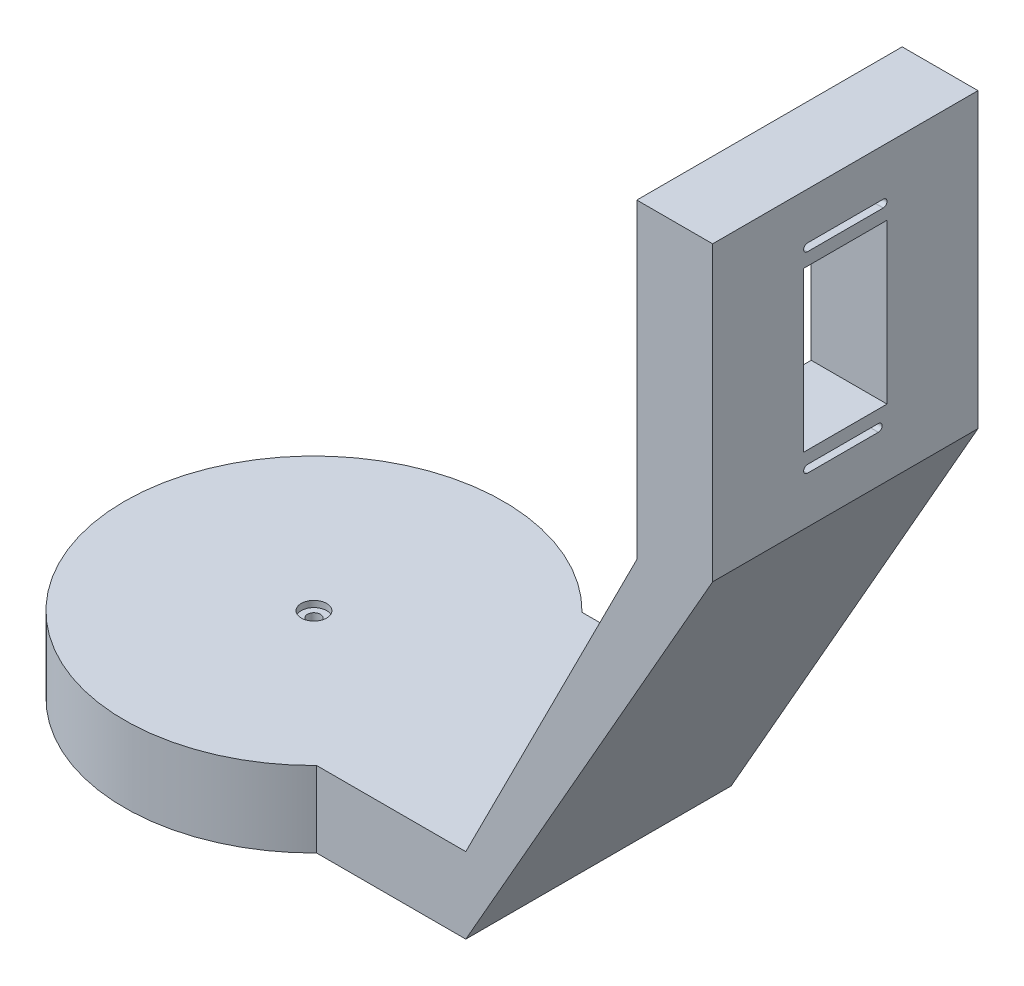
ISO-10303-21;
HEADER;
FILE_DESCRIPTION(('STEP AP214'),'2;1');
FILE_NAME('part.step','',(''),(''),'','','');
FILE_SCHEMA(('AUTOMOTIVE_DESIGN { 1 0 10303 214 1 1 1 1 }'));
ENDSEC;
DATA;
#1=APPLICATION_CONTEXT('core data for automotive mechanical design processes');
#2=APPLICATION_PROTOCOL_DEFINITION('international standard','automotive_design',2000,#1);
#3=PRODUCT_CONTEXT('',#1,'mechanical');
#4=PRODUCT('Part','Part','',(#3));
#5=PRODUCT_RELATED_PRODUCT_CATEGORY('part','',(#4));
#6=PRODUCT_DEFINITION_FORMATION('','',#4);
#7=PRODUCT_DEFINITION_CONTEXT('part definition',#1,'design');
#8=PRODUCT_DEFINITION('design','',#6,#7);
#9=PRODUCT_DEFINITION_SHAPE('','',#8);
#10=(LENGTH_UNIT() NAMED_UNIT(*) SI_UNIT(.MILLI.,.METRE.));
#11=(NAMED_UNIT(*) PLANE_ANGLE_UNIT() SI_UNIT($,.RADIAN.));
#12=(NAMED_UNIT(*) SI_UNIT($,.STERADIAN.) SOLID_ANGLE_UNIT());
#13=UNCERTAINTY_MEASURE_WITH_UNIT(LENGTH_MEASURE(1.E-05),#10,'distance_accuracy_value','');
#14=(GEOMETRIC_REPRESENTATION_CONTEXT(3) GLOBAL_UNCERTAINTY_ASSIGNED_CONTEXT((#13)) GLOBAL_UNIT_ASSIGNED_CONTEXT((#10,
#11,#12)) REPRESENTATION_CONTEXT('',''));
#15=CARTESIAN_POINT('',(0.,0.,0.));
#16=DIRECTION('',(0.,0.,1.));
#17=DIRECTION('',(1.,0.,0.));
#18=AXIS2_PLACEMENT_3D('',#15,#16,#17);
#19=CARTESIAN_POINT('',(0.,20.,0.));
#20=DIRECTION('',(0.,1.,0.));
#21=DIRECTION('',(0.,0.,1.));
#22=AXIS2_PLACEMENT_3D('',#19,#20,#21);
#23=CYLINDRICAL_SURFACE('',#22,1.7);
#24=CARTESIAN_POINT('',(0.,18.35,0.));
#25=DIRECTION('',(0.,1.,0.));
#26=DIRECTION('',(0.,0.,1.));
#27=AXIS2_PLACEMENT_3D('',#24,#25,#26);
#28=CIRCLE('',#27,1.7);
#29=CARTESIAN_POINT('',(0.,18.35,1.7));
#30=VERTEX_POINT('',#29);
#31=EDGE_CURVE('E388',#30,#30,#28,.T.);
#32=ORIENTED_EDGE('',*,*,#31,.T.);
#33=EDGE_LOOP('',(#32));
#34=FACE_BOUND('',#33,.T.);
#35=CARTESIAN_POINT('',(0.,3.5,0.));
#36=DIRECTION('',(0.,-1.,0.));
#37=DIRECTION('',(0.,0.,-1.));
#38=AXIS2_PLACEMENT_3D('',#35,#36,#37);
#39=CIRCLE('',#38,1.7);
#40=CARTESIAN_POINT('',(0.,3.5,-1.7));
#41=VERTEX_POINT('',#40);
#42=EDGE_CURVE('E42',#41,#41,#39,.F.);
#43=ORIENTED_EDGE('',*,*,#42,.F.);
#44=EDGE_LOOP('',(#43));
#45=FACE_BOUND('',#44,.T.);
#46=ADVANCED_FACE('F38',(#34,#45),#23,.F.);
#47=CARTESIAN_POINT('',(30.,2.,-0.0220346998523853));
#48=DIRECTION('',(0.,-1.,0.));
#49=DIRECTION('',(0.,0.,-1.));
#50=AXIS2_PLACEMENT_3D('',#47,#48,#49);
#51=PLANE('',#50);
#52=DIRECTION('',(0.,0.,1.));
#53=VECTOR('',#52,1.);
#54=CARTESIAN_POINT('',(10.446834113617,2.,-0.0220346998523853));
#55=LINE('',#54,#53);
#56=CARTESIAN_POINT('',(10.446834113617,2.,-4.95844978584569));
#57=VERTEX_POINT('',#56);
#58=CARTESIAN_POINT('',(10.446834113617,2.,4.94470051522393));
#59=VERTEX_POINT('',#58);
#60=EDGE_CURVE('E277',#57,#59,#55,.T.);
#61=ORIENTED_EDGE('',*,*,#60,.F.);
#62=DIRECTION('',(-0.995066694728679,0.,-0.0992082307157115));
#63=VECTOR('',#62,1.);
#64=CARTESIAN_POINT('',(29.889613094827,2.,-3.02000313383669));
#65=LINE('',#64,#63);
#66=CARTESIAN_POINT('',(29.889613094827,2.,-3.02000313383669));
#67=VERTEX_POINT('',#66);
#68=EDGE_CURVE('E301',#67,#57,#65,.T.);
#69=ORIENTED_EDGE('',*,*,#68,.F.);
#70=CARTESIAN_POINT('',(30.,2.,-0.0220346998523853));
#71=DIRECTION('',(0.,-1.,0.));
#72=DIRECTION('',(0.,0.,-1.));
#73=AXIS2_PLACEMENT_3D('',#70,#71,#72);
#74=CIRCLE('',#73,3.);
#75=CARTESIAN_POINT('',(29.9254967375497,2.,2.97704003477566));
#76=VERTEX_POINT('',#75);
#77=EDGE_CURVE('E287',#67,#76,#74,.T.);
#78=ORIENTED_EDGE('',*,*,#77,.T.);
#79=DIRECTION('',(-0.994936582249236,0.,0.100504712835816));
#80=VECTOR('',#79,1.);
#81=CARTESIAN_POINT('',(29.9254967375497,2.,2.97704003477566));
#82=LINE('',#81,#80);
#83=EDGE_CURVE('E290',#76,#59,#82,.T.);
#84=ORIENTED_EDGE('',*,*,#83,.T.);
#85=EDGE_LOOP('',(#61,#69,#78,#84));
#86=FACE_BOUND('',#85,.T.);
#87=ADVANCED_FACE('F552',(#86),#51,.T.);
#88=CARTESIAN_POINT('',(0.,20.,0.));
#89=DIRECTION('',(0.,-1.,0.));
#90=DIRECTION('',(0.,0.,-1.));
#91=AXIS2_PLACEMENT_3D('',#88,#89,#90);
#92=CYLINDRICAL_SURFACE('',#91,50.);
#93=CARTESIAN_POINT('',(0.,0.,0.));
#94=DIRECTION('',(0.,1.,0.));
#95=DIRECTION('',(0.,0.,1.));
#96=AXIS2_PLACEMENT_3D('',#93,#94,#95);
#97=CIRCLE('',#96,50.);
#98=CARTESIAN_POINT('',(35.7071421427143,0.,-35.));
#99=VERTEX_POINT('',#98);
#100=CARTESIAN_POINT('',(35.7071421427143,0.,35.));
#101=VERTEX_POINT('',#100);
#102=EDGE_CURVE('E424',#99,#101,#97,.T.);
#103=ORIENTED_EDGE('',*,*,#102,.T.);
#104=DIRECTION('',(0.,-1.,0.));
#105=VECTOR('',#104,1.);
#106=CARTESIAN_POINT('',(35.7071421427143,20.,35.));
#107=LINE('',#106,#105);
#108=CARTESIAN_POINT('',(35.7071421427143,20.,35.));
#109=VERTEX_POINT('',#108);
#110=EDGE_CURVE('E452',#109,#101,#107,.T.);
#111=ORIENTED_EDGE('',*,*,#110,.F.);
#112=CARTESIAN_POINT('',(0.,20.,0.));
#113=DIRECTION('',(0.,1.,0.));
#114=DIRECTION('',(0.,0.,1.));
#115=AXIS2_PLACEMENT_3D('',#112,#113,#114);
#116=CIRCLE('',#115,50.);
#117=CARTESIAN_POINT('',(35.7071421427143,20.,-35.));
#118=VERTEX_POINT('',#117);
#119=EDGE_CURVE('E430',#118,#109,#116,.T.);
#120=ORIENTED_EDGE('',*,*,#119,.F.);
#121=DIRECTION('',(0.,-1.,0.));
#122=VECTOR('',#121,1.);
#123=CARTESIAN_POINT('',(35.7071421427143,20.,-35.));
#124=LINE('',#123,#122);
#125=EDGE_CURVE('E442',#118,#99,#124,.T.);
#126=ORIENTED_EDGE('',*,*,#125,.T.);
#127=EDGE_LOOP('',(#103,#111,#120,#126));
#128=FACE_BOUND('',#127,.T.);
#129=ADVANCED_FACE('F40',(#128),#92,.T.);
#130=CARTESIAN_POINT('',(0.,20.,35.));
#131=DIRECTION('',(0.,0.,-1.));
#132=DIRECTION('',(-1.,0.,0.));
#133=AXIS2_PLACEMENT_3D('',#130,#131,#132);
#134=PLANE('',#133);
#135=DIRECTION('',(1.,0.,0.));
#136=VECTOR('',#135,1.);
#137=CARTESIAN_POINT('',(0.,0.,35.));
#138=LINE('',#137,#136);
#139=CARTESIAN_POINT('',(75.0554768047186,0.,35.));
#140=VERTEX_POINT('',#139);
#141=EDGE_CURVE('E445',#101,#140,#138,.T.);
#142=ORIENTED_EDGE('',*,*,#141,.T.);
#143=DIRECTION('',(0.495370386359118,0.868681863698338,0.));
#144=VECTOR('',#143,1.);
#145=CARTESIAN_POINT('',(75.0554768047186,0.,35.));
#146=LINE('',#145,#144);
#147=CARTESIAN_POINT('',(140.174133176639,114.192122372215,35.));
#148=VERTEX_POINT('',#147);
#149=EDGE_CURVE('E396',#140,#148,#146,.T.);
#150=ORIENTED_EDGE('',*,*,#149,.T.);
#151=DIRECTION('',(0.,1.,0.));
#152=VECTOR('',#151,1.);
#153=CARTESIAN_POINT('',(140.174133176639,114.192122372215,35.));
#154=LINE('',#153,#152);
#155=CARTESIAN_POINT('',(140.174133176639,191.411564080646,35.));
#156=VERTEX_POINT('',#155);
#157=EDGE_CURVE('E391',#148,#156,#154,.T.);
#158=ORIENTED_EDGE('',*,*,#157,.T.);
#159=DIRECTION('',(-1.,0.,0.));
#160=VECTOR('',#159,1.);
#161=CARTESIAN_POINT('',(140.174133176639,191.411564080646,35.));
#162=LINE('',#161,#160);
#163=CARTESIAN_POINT('',(120.174133176639,191.411564080646,35.));
#164=VERTEX_POINT('',#163);
#165=EDGE_CURVE('E411',#156,#164,#162,.T.);
#166=ORIENTED_EDGE('',*,*,#165,.T.);
#167=DIRECTION('',(0.,-1.,0.));
#168=VECTOR('',#167,1.);
#169=CARTESIAN_POINT('',(120.174133176639,191.411564080646,35.));
#170=LINE('',#169,#168);
#171=CARTESIAN_POINT('',(120.174133176639,109.286292207177,35.));
#172=VERTEX_POINT('',#171);
#173=EDGE_CURVE('E414',#164,#172,#170,.T.);
#174=ORIENTED_EDGE('',*,*,#173,.T.);
#175=DIRECTION('',(-0.451012165575392,-0.892517801784925,0.));
#176=VECTOR('',#175,1.);
#177=CARTESIAN_POINT('',(120.174133176639,109.286292207177,35.));
#178=LINE('',#177,#176);
#179=CARTESIAN_POINT('',(75.0554768047186,20.,35.));
#180=VERTEX_POINT('',#179);
#181=EDGE_CURVE('E417',#172,#180,#178,.T.);
#182=ORIENTED_EDGE('',*,*,#181,.T.);
#183=DIRECTION('',(1.,0.,0.));
#184=VECTOR('',#183,1.);
#185=CARTESIAN_POINT('',(0.,20.,35.));
#186=LINE('',#185,#184);
#187=EDGE_CURVE('E433',#109,#180,#186,.T.);
#188=ORIENTED_EDGE('',*,*,#187,.F.);
#189=ORIENTED_EDGE('',*,*,#110,.T.);
#190=EDGE_LOOP('',(#142,#150,#158,#166,#174,#182,#188,#189));
#191=FACE_BOUND('',#190,.T.);
#192=ADVANCED_FACE('F517',(#191),#134,.F.);
#193=CARTESIAN_POINT('',(0.,20.,-35.));
#194=DIRECTION('',(0.,0.,-1.));
#195=DIRECTION('',(-1.,0.,0.));
#196=AXIS2_PLACEMENT_3D('',#193,#194,#195);
#197=PLANE('',#196);
#198=DIRECTION('',(1.,0.,0.));
#199=VECTOR('',#198,1.);
#200=CARTESIAN_POINT('',(0.,0.,-35.));
#201=LINE('',#200,#199);
#202=CARTESIAN_POINT('',(75.0554768047186,0.,-35.));
#203=VERTEX_POINT('',#202);
#204=EDGE_CURVE('E434',#99,#203,#201,.T.);
#205=ORIENTED_EDGE('',*,*,#204,.F.);
#206=ORIENTED_EDGE('',*,*,#125,.F.);
#207=DIRECTION('',(1.,0.,0.));
#208=VECTOR('',#207,1.);
#209=CARTESIAN_POINT('',(0.,20.,-35.));
#210=LINE('',#209,#208);
#211=CARTESIAN_POINT('',(75.0554768047186,20.,-35.));
#212=VERTEX_POINT('',#211);
#213=EDGE_CURVE('E439',#118,#212,#210,.T.);
#214=ORIENTED_EDGE('',*,*,#213,.T.);
#215=DIRECTION('',(-0.451012165575392,-0.892517801784925,0.));
#216=VECTOR('',#215,1.);
#217=CARTESIAN_POINT('',(120.174133176639,109.286292207177,-35.));
#218=LINE('',#217,#216);
#219=CARTESIAN_POINT('',(120.174133176639,109.286292207177,-35.));
#220=VERTEX_POINT('',#219);
#221=EDGE_CURVE('E402',#220,#212,#218,.T.);
#222=ORIENTED_EDGE('',*,*,#221,.F.);
#223=DIRECTION('',(0.,-1.,0.));
#224=VECTOR('',#223,1.);
#225=CARTESIAN_POINT('',(120.174133176639,191.411564080646,-35.));
#226=LINE('',#225,#224);
#227=CARTESIAN_POINT('',(120.174133176639,191.411564080646,-35.));
#228=VERTEX_POINT('',#227);
#229=EDGE_CURVE('E399',#228,#220,#226,.T.);
#230=ORIENTED_EDGE('',*,*,#229,.F.);
#231=DIRECTION('',(-1.,0.,0.));
#232=VECTOR('',#231,1.);
#233=CARTESIAN_POINT('',(140.174133176639,191.411564080646,-35.));
#234=LINE('',#233,#232);
#235=CARTESIAN_POINT('',(140.174133176639,191.411564080646,-35.));
#236=VERTEX_POINT('',#235);
#237=EDGE_CURVE('E395',#236,#228,#234,.T.);
#238=ORIENTED_EDGE('',*,*,#237,.F.);
#239=DIRECTION('',(0.,1.,0.));
#240=VECTOR('',#239,1.);
#241=CARTESIAN_POINT('',(140.174133176639,114.192122372215,-35.));
#242=LINE('',#241,#240);
#243=CARTESIAN_POINT('',(140.174133176639,114.192122372215,-35.));
#244=VERTEX_POINT('',#243);
#245=EDGE_CURVE('E392',#244,#236,#242,.T.);
#246=ORIENTED_EDGE('',*,*,#245,.F.);
#247=DIRECTION('',(0.495370386359118,0.868681863698338,0.));
#248=VECTOR('',#247,1.);
#249=CARTESIAN_POINT('',(75.0554768047186,0.,-35.));
#250=LINE('',#249,#248);
#251=EDGE_CURVE('E405',#203,#244,#250,.T.);
#252=ORIENTED_EDGE('',*,*,#251,.F.);
#253=EDGE_LOOP('',(#205,#206,#214,#222,#230,#238,#246,#252));
#254=FACE_BOUND('',#253,.T.);
#255=ADVANCED_FACE('F523',(#254),#197,.T.);
#256=CARTESIAN_POINT('',(0.,20.,0.));
#257=DIRECTION('',(0.,1.,0.));
#258=DIRECTION('',(0.,0.,1.));
#259=AXIS2_PLACEMENT_3D('',#256,#257,#258);
#260=PLANE('',#259);
#261=CARTESIAN_POINT('',(0.,20.,0.));
#262=DIRECTION('',(0.,1.,0.));
#263=DIRECTION('',(0.,0.,1.));
#264=AXIS2_PLACEMENT_3D('',#261,#262,#263);
#265=CIRCLE('',#264,3.35);
#266=CARTESIAN_POINT('',(0.,20.,3.35));
#267=VERTEX_POINT('',#266);
#268=EDGE_CURVE('E376',#267,#267,#265,.T.);
#269=ORIENTED_EDGE('',*,*,#268,.F.);
#270=EDGE_LOOP('',(#269));
#271=FACE_BOUND('',#270,.T.);
#272=ORIENTED_EDGE('',*,*,#119,.T.);
#273=ORIENTED_EDGE('',*,*,#187,.T.);
#274=DIRECTION('',(0.,0.,1.));
#275=VECTOR('',#274,1.);
#276=CARTESIAN_POINT('',(75.0554768047186,20.,0.));
#277=LINE('',#276,#275);
#278=EDGE_CURVE('E436',#212,#180,#277,.T.);
#279=ORIENTED_EDGE('',*,*,#278,.F.);
#280=ORIENTED_EDGE('',*,*,#213,.F.);
#281=EDGE_LOOP('',(#272,#273,#279,#280));
#282=FACE_BOUND('',#281,.T.);
#283=ADVANCED_FACE('F536',(#271,#282),#260,.T.);
#284=CARTESIAN_POINT('',(0.,0.,0.));
#285=DIRECTION('',(0.,1.,0.));
#286=DIRECTION('',(0.,0.,1.));
#287=AXIS2_PLACEMENT_3D('',#284,#285,#286);
#288=PLANE('',#287);
#289=DIRECTION('',(-0.994936582249236,0.,0.100504712835816));
#290=VECTOR('',#289,1.);
#291=CARTESIAN_POINT('',(29.9254967375497,0.,2.97704003477566));
#292=LINE('',#291,#290);
#293=CARTESIAN_POINT('',(29.9254967375497,0.,2.97704003477566));
#294=VERTEX_POINT('',#293);
#295=CARTESIAN_POINT('',(0.,0.,6.));
#296=VERTEX_POINT('',#295);
#297=EDGE_CURVE('E245',#294,#296,#292,.T.);
#298=ORIENTED_EDGE('',*,*,#297,.F.);
#299=CARTESIAN_POINT('',(30.,0.,-0.0220346998523853));
#300=DIRECTION('',(0.,-1.,0.));
#301=DIRECTION('',(0.,0.,-1.));
#302=AXIS2_PLACEMENT_3D('',#299,#300,#301);
#303=CIRCLE('',#302,3.);
#304=CARTESIAN_POINT('',(29.889613094827,0.,-3.02000313383669));
#305=VERTEX_POINT('',#304);
#306=EDGE_CURVE('E54',#305,#294,#303,.T.);
#307=ORIENTED_EDGE('',*,*,#306,.F.);
#308=DIRECTION('',(-0.995066694728679,0.,-0.0992082307157115));
#309=VECTOR('',#308,1.);
#310=CARTESIAN_POINT('',(29.889613094827,0.,-3.02000313383669));
#311=LINE('',#310,#309);
#312=CARTESIAN_POINT('',(0.,0.,-6.));
#313=VERTEX_POINT('',#312);
#314=EDGE_CURVE('E291',#305,#313,#311,.T.);
#315=ORIENTED_EDGE('',*,*,#314,.T.);
#316=DIRECTION('',(0.998337055490868,0.,-0.0576465405191379));
#317=VECTOR('',#316,1.);
#318=CARTESIAN_POINT('',(-30.0737171703665,0.,-4.26346648570486));
#319=LINE('',#318,#317);
#320=CARTESIAN_POINT('',(-30.0737171703665,0.,-4.26346648570486));
#321=VERTEX_POINT('',#320);
#322=EDGE_CURVE('E311',#321,#313,#319,.T.);
#323=ORIENTED_EDGE('',*,*,#322,.F.);
#324=CARTESIAN_POINT('',(-30.,0.,-0.640077242931038));
#325=DIRECTION('',(0.,1.,0.));
#326=DIRECTION('',(0.,0.,1.));
#327=AXIS2_PLACEMENT_3D('',#324,#325,#326);
#328=CIRCLE('',#327,3.6241390461537);
#329=CARTESIAN_POINT('',(-29.9389781936391,0.,2.98354803639964));
#330=VERTEX_POINT('',#329);
#331=EDGE_CURVE('E308',#321,#330,#328,.T.);
#332=ORIENTED_EDGE('',*,*,#331,.T.);
#333=DIRECTION('',(0.994962701350082,0.,0.100245812491832));
#334=VECTOR('',#333,1.);
#335=CARTESIAN_POINT('',(-29.9389781936391,0.,2.98354803639964));
#336=LINE('',#335,#334);
#337=EDGE_CURVE('E306',#330,#296,#336,.T.);
#338=ORIENTED_EDGE('',*,*,#337,.T.);
#339=EDGE_LOOP('',(#298,#307,#315,#323,#332,#338));
#340=FACE_BOUND('',#339,.T.);
#341=ORIENTED_EDGE('',*,*,#102,.F.);
#342=ORIENTED_EDGE('',*,*,#204,.T.);
#343=DIRECTION('',(0.,0.,1.));
#344=VECTOR('',#343,1.);
#345=CARTESIAN_POINT('',(75.0554768047186,0.,0.));
#346=LINE('',#345,#344);
#347=EDGE_CURVE('E448',#203,#140,#346,.T.);
#348=ORIENTED_EDGE('',*,*,#347,.T.);
#349=ORIENTED_EDGE('',*,*,#141,.F.);
#350=EDGE_LOOP('',(#341,#342,#348,#349));
#351=FACE_BOUND('',#350,.T.);
#352=ADVANCED_FACE('F502',(#340,#351),#288,.F.);
#353=CARTESIAN_POINT('',(140.174133176639,114.192122372215,-35.));
#354=DIRECTION('',(1.,0.,0.));
#355=DIRECTION('',(0.,0.,-1.));
#356=AXIS2_PLACEMENT_3D('',#353,#354,#355);
#357=PLANE('',#356);
#358=CARTESIAN_POINT('',(140.174133176639,178.101564080646,10.));
#359=DIRECTION('',(1.,0.,0.));
#360=DIRECTION('',(0.,0.,-1.));
#361=AXIS2_PLACEMENT_3D('',#358,#359,#360);
#362=CIRCLE('',#361,1.);
#363=CARTESIAN_POINT('',(140.174133176639,179.101564080646,10.));
#364=VERTEX_POINT('',#363);
#365=CARTESIAN_POINT('',(140.174133176639,177.101564080646,10.));
#366=VERTEX_POINT('',#365);
#367=EDGE_CURVE('E62',#364,#366,#362,.T.);
#368=ORIENTED_EDGE('',*,*,#367,.F.);
#369=DIRECTION('',(0.,0.,1.));
#370=VECTOR('',#369,1.);
#371=CARTESIAN_POINT('',(140.174133176639,179.101564080646,10.));
#372=LINE('',#371,#370);
#373=CARTESIAN_POINT('',(140.174133176639,179.101564080646,-10.));
#374=VERTEX_POINT('',#373);
#375=EDGE_CURVE('E333',#374,#364,#372,.T.);
#376=ORIENTED_EDGE('',*,*,#375,.F.);
#377=CARTESIAN_POINT('',(140.174133176639,178.101564080646,-10.));
#378=DIRECTION('',(1.,0.,0.));
#379=DIRECTION('',(0.,0.,1.));
#380=AXIS2_PLACEMENT_3D('',#377,#378,#379);
#381=CIRCLE('',#380,1.);
#382=CARTESIAN_POINT('',(140.174133176639,177.101564080646,-10.));
#383=VERTEX_POINT('',#382);
#384=EDGE_CURVE('E330',#383,#374,#381,.T.);
#385=ORIENTED_EDGE('',*,*,#384,.F.);
#386=DIRECTION('',(0.,0.,-1.));
#387=VECTOR('',#386,1.);
#388=CARTESIAN_POINT('',(140.174133176639,177.101564080646,10.));
#389=LINE('',#388,#387);
#390=EDGE_CURVE('E326',#366,#383,#389,.T.);
#391=ORIENTED_EDGE('',*,*,#390,.F.);
#392=EDGE_LOOP('',(#368,#376,#385,#391));
#393=FACE_BOUND('',#392,.T.);
#394=CARTESIAN_POINT('',(140.174133176639,127.501564080646,10.));
#395=DIRECTION('',(1.,0.,0.));
#396=DIRECTION('',(0.,0.,-1.));
#397=AXIS2_PLACEMENT_3D('',#394,#395,#396);
#398=CIRCLE('',#397,1.);
#399=CARTESIAN_POINT('',(140.174133176639,128.501564080646,10.));
#400=VERTEX_POINT('',#399);
#401=CARTESIAN_POINT('',(140.174133176639,126.501564080646,10.));
#402=VERTEX_POINT('',#401);
#403=EDGE_CURVE('E317',#400,#402,#398,.T.);
#404=ORIENTED_EDGE('',*,*,#403,.F.);
#405=DIRECTION('',(0.,0.,1.));
#406=VECTOR('',#405,1.);
#407=CARTESIAN_POINT('',(140.174133176639,128.501564080646,10.));
#408=LINE('',#407,#406);
#409=CARTESIAN_POINT('',(140.174133176639,128.501564080646,-8.70627595615708));
#410=VERTEX_POINT('',#409);
#411=EDGE_CURVE('E352',#410,#400,#408,.T.);
#412=ORIENTED_EDGE('',*,*,#411,.F.);
#413=CARTESIAN_POINT('',(140.174133176639,127.501564080646,-8.70627595615708));
#414=DIRECTION('',(1.,0.,0.));
#415=DIRECTION('',(0.,0.,1.));
#416=AXIS2_PLACEMENT_3D('',#413,#414,#415);
#417=CIRCLE('',#416,1.00000000000003);
#418=CARTESIAN_POINT('',(140.174133176639,126.501564080646,-8.70627595615708));
#419=VERTEX_POINT('',#418);
#420=EDGE_CURVE('E349',#419,#410,#417,.T.);
#421=ORIENTED_EDGE('',*,*,#420,.F.);
#422=DIRECTION('',(0.,0.,-1.));
#423=VECTOR('',#422,1.);
#424=CARTESIAN_POINT('',(140.174133176639,126.501564080646,10.));
#425=LINE('',#424,#423);
#426=EDGE_CURVE('E346',#402,#419,#425,.T.);
#427=ORIENTED_EDGE('',*,*,#426,.F.);
#428=EDGE_LOOP('',(#404,#412,#421,#427));
#429=FACE_BOUND('',#428,.T.);
#430=DIRECTION('',(0.,-1.,0.));
#431=VECTOR('',#430,1.);
#432=CARTESIAN_POINT('',(140.174133176639,173.801564080646,11.));
#433=LINE('',#432,#431);
#434=CARTESIAN_POINT('',(140.174133176639,173.801564080646,11.));
#435=VERTEX_POINT('',#434);
#436=CARTESIAN_POINT('',(140.174133176639,131.801564080646,11.));
#437=VERTEX_POINT('',#436);
#438=EDGE_CURVE('E339',#435,#437,#433,.T.);
#439=ORIENTED_EDGE('',*,*,#438,.F.);
#440=DIRECTION('',(0.,0.,1.));
#441=VECTOR('',#440,1.);
#442=CARTESIAN_POINT('',(140.174133176639,173.801564080646,11.));
#443=LINE('',#442,#441);
#444=CARTESIAN_POINT('',(140.174133176639,173.801564080646,-11.));
#445=VERTEX_POINT('',#444);
#446=EDGE_CURVE('E370',#445,#435,#443,.T.);
#447=ORIENTED_EDGE('',*,*,#446,.F.);
#448=DIRECTION('',(0.,1.,0.));
#449=VECTOR('',#448,1.);
#450=CARTESIAN_POINT('',(140.174133176639,173.801564080646,-11.));
#451=LINE('',#450,#449);
#452=CARTESIAN_POINT('',(140.174133176639,131.801564080646,-11.));
#453=VERTEX_POINT('',#452);
#454=EDGE_CURVE('E367',#453,#445,#451,.T.);
#455=ORIENTED_EDGE('',*,*,#454,.F.);
#456=DIRECTION('',(0.,0.,-1.));
#457=VECTOR('',#456,1.);
#458=CARTESIAN_POINT('',(140.174133176639,131.801564080646,11.));
#459=LINE('',#458,#457);
#460=EDGE_CURVE('E364',#437,#453,#459,.T.);
#461=ORIENTED_EDGE('',*,*,#460,.F.);
#462=EDGE_LOOP('',(#439,#447,#455,#461));
#463=FACE_BOUND('',#462,.T.);
#464=ORIENTED_EDGE('',*,*,#157,.F.);
#465=DIRECTION('',(0.,0.,1.));
#466=VECTOR('',#465,1.);
#467=CARTESIAN_POINT('',(140.174133176639,114.192122372215,-35.));
#468=LINE('',#467,#466);
#469=EDGE_CURVE('E422',#244,#148,#468,.T.);
#470=ORIENTED_EDGE('',*,*,#469,.F.);
#471=ORIENTED_EDGE('',*,*,#245,.T.);
#472=DIRECTION('',(0.,0.,1.));
#473=VECTOR('',#472,1.);
#474=CARTESIAN_POINT('',(140.174133176639,191.411564080646,-35.));
#475=LINE('',#474,#473);
#476=EDGE_CURVE('E408',#236,#156,#475,.T.);
#477=ORIENTED_EDGE('',*,*,#476,.T.);
#478=EDGE_LOOP('',(#464,#470,#471,#477));
#479=FACE_BOUND('',#478,.T.);
#480=ADVANCED_FACE('F498',(#393,#429,#463,#479),#357,.T.);
#481=CARTESIAN_POINT('',(75.0554768047186,0.,-35.));
#482=DIRECTION('',(0.868681863698338,-0.495370386359118,0.));
#483=DIRECTION('',(0.495370386359118,0.868681863698338,0.));
#484=AXIS2_PLACEMENT_3D('',#481,#482,#483);
#485=PLANE('',#484);
#486=ORIENTED_EDGE('',*,*,#149,.F.);
#487=ORIENTED_EDGE('',*,*,#347,.F.);
#488=ORIENTED_EDGE('',*,*,#251,.T.);
#489=ORIENTED_EDGE('',*,*,#469,.T.);
#490=EDGE_LOOP('',(#486,#487,#488,#489));
#491=FACE_BOUND('',#490,.T.);
#492=ADVANCED_FACE('F501',(#491),#485,.T.);
#493=CARTESIAN_POINT('',(120.174133176639,109.286292207177,-35.));
#494=DIRECTION('',(-0.892517801784925,0.451012165575392,0.));
#495=DIRECTION('',(-0.451012165575392,-0.892517801784925,0.));
#496=AXIS2_PLACEMENT_3D('',#493,#494,#495);
#497=PLANE('',#496);
#498=ORIENTED_EDGE('',*,*,#181,.F.);
#499=DIRECTION('',(0.,0.,1.));
#500=VECTOR('',#499,1.);
#501=CARTESIAN_POINT('',(120.174133176639,109.286292207177,-35.));
#502=LINE('',#501,#500);
#503=EDGE_CURVE('E425',#220,#172,#502,.T.);
#504=ORIENTED_EDGE('',*,*,#503,.F.);
#505=ORIENTED_EDGE('',*,*,#221,.T.);
#506=ORIENTED_EDGE('',*,*,#278,.T.);
#507=EDGE_LOOP('',(#498,#504,#505,#506));
#508=FACE_BOUND('',#507,.T.);
#509=ADVANCED_FACE('F533',(#508),#497,.T.);
#510=CARTESIAN_POINT('',(120.174133176639,191.411564080646,-35.));
#511=DIRECTION('',(-1.,0.,0.));
#512=DIRECTION('',(0.,0.,1.));
#513=AXIS2_PLACEMENT_3D('',#510,#511,#512);
#514=PLANE('',#513);
#515=CARTESIAN_POINT('',(120.174133176639,178.101564080646,10.));
#516=DIRECTION('',(-1.,0.,0.));
#517=DIRECTION('',(0.,0.,1.));
#518=AXIS2_PLACEMENT_3D('',#515,#516,#517);
#519=CIRCLE('',#518,1.);
#520=CARTESIAN_POINT('',(120.174133176639,177.101564080646,10.));
#521=VERTEX_POINT('',#520);
#522=CARTESIAN_POINT('',(120.174133176639,179.101564080646,10.));
#523=VERTEX_POINT('',#522);
#524=EDGE_CURVE('E11',#521,#523,#519,.T.);
#525=ORIENTED_EDGE('',*,*,#524,.F.);
#526=DIRECTION('',(0.,0.,1.));
#527=VECTOR('',#526,1.);
#528=CARTESIAN_POINT('',(120.174133176639,177.101564080646,-35.));
#529=LINE('',#528,#527);
#530=CARTESIAN_POINT('',(120.174133176639,177.101564080646,-9.99999999999999));
#531=VERTEX_POINT('',#530);
#532=EDGE_CURVE('E473',#531,#521,#529,.T.);
#533=ORIENTED_EDGE('',*,*,#532,.F.);
#534=CARTESIAN_POINT('',(120.174133176639,178.101564080646,-10.));
#535=DIRECTION('',(-1.,0.,0.));
#536=DIRECTION('',(0.,0.,1.));
#537=AXIS2_PLACEMENT_3D('',#534,#535,#536);
#538=CIRCLE('',#537,1.);
#539=CARTESIAN_POINT('',(120.174133176639,179.101564080646,-10.));
#540=VERTEX_POINT('',#539);
#541=EDGE_CURVE('E475',#540,#531,#538,.T.);
#542=ORIENTED_EDGE('',*,*,#541,.F.);
#543=DIRECTION('',(0.,0.,-1.));
#544=VECTOR('',#543,1.);
#545=CARTESIAN_POINT('',(120.174133176639,179.101564080646,-35.));
#546=LINE('',#545,#544);
#547=EDGE_CURVE('E47',#523,#540,#546,.T.);
#548=ORIENTED_EDGE('',*,*,#547,.F.);
#549=EDGE_LOOP('',(#525,#533,#542,#548));
#550=FACE_BOUND('',#549,.T.);
#551=CARTESIAN_POINT('',(120.174133176639,127.501564080646,10.));
#552=DIRECTION('',(-1.,0.,0.));
#553=DIRECTION('',(0.,0.,1.));
#554=AXIS2_PLACEMENT_3D('',#551,#552,#553);
#555=CIRCLE('',#554,1.);
#556=CARTESIAN_POINT('',(120.174133176639,126.501564080646,10.));
#557=VERTEX_POINT('',#556);
#558=CARTESIAN_POINT('',(120.174133176639,128.501564080646,10.));
#559=VERTEX_POINT('',#558);
#560=EDGE_CURVE('E471',#557,#559,#555,.T.);
#561=ORIENTED_EDGE('',*,*,#560,.F.);
#562=DIRECTION('',(0.,0.,1.));
#563=VECTOR('',#562,1.);
#564=CARTESIAN_POINT('',(120.174133176639,126.501564080646,-34.9999999999999));
#565=LINE('',#564,#563);
#566=CARTESIAN_POINT('',(120.174133176639,126.501564080646,-8.70627595615708));
#567=VERTEX_POINT('',#566);
#568=EDGE_CURVE('E464',#567,#557,#565,.T.);
#569=ORIENTED_EDGE('',*,*,#568,.F.);
#570=CARTESIAN_POINT('',(120.174133176639,127.501564080646,-8.70627595615708));
#571=DIRECTION('',(-1.,0.,0.));
#572=DIRECTION('',(0.,0.,1.));
#573=AXIS2_PLACEMENT_3D('',#570,#571,#572);
#574=CIRCLE('',#573,1.00000000000003);
#575=CARTESIAN_POINT('',(120.174133176639,128.501564080646,-8.70627595615708));
#576=VERTEX_POINT('',#575);
#577=EDGE_CURVE('E466',#576,#567,#574,.T.);
#578=ORIENTED_EDGE('',*,*,#577,.F.);
#579=DIRECTION('',(0.,0.,-1.));
#580=VECTOR('',#579,1.);
#581=CARTESIAN_POINT('',(120.174133176639,128.501564080646,-35.0000000000001));
#582=LINE('',#581,#580);
#583=EDGE_CURVE('E469',#559,#576,#582,.T.);
#584=ORIENTED_EDGE('',*,*,#583,.F.);
#585=EDGE_LOOP('',(#561,#569,#578,#584));
#586=FACE_BOUND('',#585,.T.);
#587=DIRECTION('',(0.,1.,0.));
#588=VECTOR('',#587,1.);
#589=CARTESIAN_POINT('',(120.174133176639,191.411564080646,11.));
#590=LINE('',#589,#588);
#591=CARTESIAN_POINT('',(120.174133176639,131.801564080646,11.));
#592=VERTEX_POINT('',#591);
#593=CARTESIAN_POINT('',(120.174133176639,173.801564080646,11.));
#594=VERTEX_POINT('',#593);
#595=EDGE_CURVE('E462',#592,#594,#590,.T.);
#596=ORIENTED_EDGE('',*,*,#595,.F.);
#597=DIRECTION('',(0.,0.,1.));
#598=VECTOR('',#597,1.);
#599=CARTESIAN_POINT('',(120.174133176639,131.801564080646,-35.));
#600=LINE('',#599,#598);
#601=CARTESIAN_POINT('',(120.174133176639,131.801564080646,-11.));
#602=VERTEX_POINT('',#601);
#603=EDGE_CURVE('E455',#602,#592,#600,.T.);
#604=ORIENTED_EDGE('',*,*,#603,.F.);
#605=DIRECTION('',(0.,-1.,0.));
#606=VECTOR('',#605,1.);
#607=CARTESIAN_POINT('',(120.174133176639,191.411564080646,-11.));
#608=LINE('',#607,#606);
#609=CARTESIAN_POINT('',(120.174133176639,173.801564080646,-11.));
#610=VERTEX_POINT('',#609);
#611=EDGE_CURVE('E457',#610,#602,#608,.T.);
#612=ORIENTED_EDGE('',*,*,#611,.F.);
#613=DIRECTION('',(0.,0.,-1.));
#614=VECTOR('',#613,1.);
#615=CARTESIAN_POINT('',(120.174133176639,173.801564080646,-35.));
#616=LINE('',#615,#614);
#617=EDGE_CURVE('E460',#594,#610,#616,.T.);
#618=ORIENTED_EDGE('',*,*,#617,.F.);
#619=EDGE_LOOP('',(#596,#604,#612,#618));
#620=FACE_BOUND('',#619,.T.);
#621=ORIENTED_EDGE('',*,*,#173,.F.);
#622=DIRECTION('',(0.,0.,1.));
#623=VECTOR('',#622,1.);
#624=CARTESIAN_POINT('',(120.174133176639,191.411564080646,-35.));
#625=LINE('',#624,#623);
#626=EDGE_CURVE('E427',#228,#164,#625,.T.);
#627=ORIENTED_EDGE('',*,*,#626,.F.);
#628=ORIENTED_EDGE('',*,*,#229,.T.);
#629=ORIENTED_EDGE('',*,*,#503,.T.);
#630=EDGE_LOOP('',(#621,#627,#628,#629));
#631=FACE_BOUND('',#630,.T.);
#632=ADVANCED_FACE('F491',(#550,#586,#620,#631),#514,.T.);
#633=CARTESIAN_POINT('',(140.174133176639,191.411564080646,-35.));
#634=DIRECTION('',(0.,1.,0.));
#635=DIRECTION('',(0.,0.,1.));
#636=AXIS2_PLACEMENT_3D('',#633,#634,#635);
#637=PLANE('',#636);
#638=ORIENTED_EDGE('',*,*,#165,.F.);
#639=ORIENTED_EDGE('',*,*,#476,.F.);
#640=ORIENTED_EDGE('',*,*,#237,.T.);
#641=ORIENTED_EDGE('',*,*,#626,.T.);
#642=EDGE_LOOP('',(#638,#639,#640,#641));
#643=FACE_BOUND('',#642,.T.);
#644=ADVANCED_FACE('F528',(#643),#637,.T.);
#645=CARTESIAN_POINT('',(1.7,18.35,0.));
#646=DIRECTION('',(0.,-1.,0.));
#647=DIRECTION('',(0.,0.,-1.));
#648=AXIS2_PLACEMENT_3D('',#645,#646,#647);
#649=PLANE('',#648);
#650=ORIENTED_EDGE('',*,*,#31,.F.);
#651=EDGE_LOOP('',(#650));
#652=FACE_BOUND('',#651,.T.);
#653=CARTESIAN_POINT('',(0.,18.35,0.));
#654=DIRECTION('',(0.,1.,0.));
#655=DIRECTION('',(0.,0.,1.));
#656=AXIS2_PLACEMENT_3D('',#653,#654,#655);
#657=CIRCLE('',#656,3.35);
#658=CARTESIAN_POINT('',(0.,18.35,3.35));
#659=VERTEX_POINT('',#658);
#660=EDGE_CURVE('E385',#659,#659,#657,.T.);
#661=ORIENTED_EDGE('',*,*,#660,.T.);
#662=EDGE_LOOP('',(#661));
#663=FACE_BOUND('',#662,.T.);
#664=ADVANCED_FACE('F564',(#652,#663),#649,.F.);
#665=CARTESIAN_POINT('',(0.,20.,0.));
#666=DIRECTION('',(0.,1.,0.));
#667=DIRECTION('',(0.,0.,1.));
#668=AXIS2_PLACEMENT_3D('',#665,#666,#667);
#669=CYLINDRICAL_SURFACE('',#668,3.35);
#670=ORIENTED_EDGE('',*,*,#660,.F.);
#671=EDGE_LOOP('',(#670));
#672=FACE_BOUND('',#671,.T.);
#673=ORIENTED_EDGE('',*,*,#268,.T.);
#674=EDGE_LOOP('',(#673));
#675=FACE_BOUND('',#674,.T.);
#676=ADVANCED_FACE('F576',(#672,#675),#669,.F.);
#677=CARTESIAN_POINT('',(108.174133176639,173.801564080646,11.));
#678=DIRECTION('',(0.,0.,1.));
#679=DIRECTION('',(0.,-1.,0.));
#680=AXIS2_PLACEMENT_3D('',#677,#678,#679);
#681=PLANE('',#680);
#682=ORIENTED_EDGE('',*,*,#595,.T.);
#683=DIRECTION('',(1.,0.,0.));
#684=VECTOR('',#683,1.);
#685=CARTESIAN_POINT('',(108.174133176639,173.801564080646,11.));
#686=LINE('',#685,#684);
#687=EDGE_CURVE('E374',#594,#435,#686,.T.);
#688=ORIENTED_EDGE('',*,*,#687,.T.);
#689=ORIENTED_EDGE('',*,*,#438,.T.);
#690=DIRECTION('',(1.,0.,0.));
#691=VECTOR('',#690,1.);
#692=CARTESIAN_POINT('',(108.174133176639,131.801564080646,11.));
#693=LINE('',#692,#691);
#694=EDGE_CURVE('E373',#592,#437,#693,.T.);
#695=ORIENTED_EDGE('',*,*,#694,.F.);
#696=EDGE_LOOP('',(#682,#688,#689,#695));
#697=FACE_BOUND('',#696,.T.);
#698=ADVANCED_FACE('F581',(#697),#681,.F.);
#699=CARTESIAN_POINT('',(108.174133176639,173.801564080646,11.));
#700=DIRECTION('',(0.,1.,0.));
#701=DIRECTION('',(0.,0.,1.));
#702=AXIS2_PLACEMENT_3D('',#699,#700,#701);
#703=PLANE('',#702);
#704=ORIENTED_EDGE('',*,*,#617,.T.);
#705=DIRECTION('',(1.,0.,0.));
#706=VECTOR('',#705,1.);
#707=CARTESIAN_POINT('',(108.174133176639,173.801564080646,-11.));
#708=LINE('',#707,#706);
#709=EDGE_CURVE('E377',#610,#445,#708,.T.);
#710=ORIENTED_EDGE('',*,*,#709,.T.);
#711=ORIENTED_EDGE('',*,*,#446,.T.);
#712=ORIENTED_EDGE('',*,*,#687,.F.);
#713=EDGE_LOOP('',(#704,#710,#711,#712));
#714=FACE_BOUND('',#713,.T.);
#715=ADVANCED_FACE('F591',(#714),#703,.F.);
#716=CARTESIAN_POINT('',(108.174133176639,173.801564080646,-11.));
#717=DIRECTION('',(0.,0.,-1.));
#718=DIRECTION('',(0.,1.,0.));
#719=AXIS2_PLACEMENT_3D('',#716,#717,#718);
#720=PLANE('',#719);
#721=ORIENTED_EDGE('',*,*,#611,.T.);
#722=DIRECTION('',(1.,0.,0.));
#723=VECTOR('',#722,1.);
#724=CARTESIAN_POINT('',(108.174133176639,131.801564080646,-11.));
#725=LINE('',#724,#723);
#726=EDGE_CURVE('E379',#602,#453,#725,.T.);
#727=ORIENTED_EDGE('',*,*,#726,.T.);
#728=ORIENTED_EDGE('',*,*,#454,.T.);
#729=ORIENTED_EDGE('',*,*,#709,.F.);
#730=EDGE_LOOP('',(#721,#727,#728,#729));
#731=FACE_BOUND('',#730,.T.);
#732=ADVANCED_FACE('F599',(#731),#720,.F.);
#733=CARTESIAN_POINT('',(108.174133176639,131.801564080646,11.));
#734=DIRECTION('',(0.,-1.,0.));
#735=DIRECTION('',(0.,0.,-1.));
#736=AXIS2_PLACEMENT_3D('',#733,#734,#735);
#737=PLANE('',#736);
#738=ORIENTED_EDGE('',*,*,#603,.T.);
#739=ORIENTED_EDGE('',*,*,#694,.T.);
#740=ORIENTED_EDGE('',*,*,#460,.T.);
#741=ORIENTED_EDGE('',*,*,#726,.F.);
#742=EDGE_LOOP('',(#738,#739,#740,#741));
#743=FACE_BOUND('',#742,.T.);
#744=ADVANCED_FACE('F595',(#743),#737,.F.);
#745=CARTESIAN_POINT('',(73.1741331766393,127.501564080646,10.));
#746=DIRECTION('',(1.,0.,0.));
#747=DIRECTION('',(0.,0.,-1.));
#748=AXIS2_PLACEMENT_3D('',#745,#746,#747);
#749=CYLINDRICAL_SURFACE('',#748,1.);
#750=ORIENTED_EDGE('',*,*,#560,.T.);
#751=DIRECTION('',(1.,0.,0.));
#752=VECTOR('',#751,1.);
#753=CARTESIAN_POINT('',(73.1741331766393,128.501564080646,10.));
#754=LINE('',#753,#752);
#755=EDGE_CURVE('E327',#559,#400,#754,.T.);
#756=ORIENTED_EDGE('',*,*,#755,.T.);
#757=ORIENTED_EDGE('',*,*,#403,.T.);
#758=DIRECTION('',(1.,0.,0.));
#759=VECTOR('',#758,1.);
#760=CARTESIAN_POINT('',(73.1741331766393,126.501564080646,10.));
#761=LINE('',#760,#759);
#762=EDGE_CURVE('E355',#557,#402,#761,.T.);
#763=ORIENTED_EDGE('',*,*,#762,.F.);
#764=EDGE_LOOP('',(#750,#756,#757,#763));
#765=FACE_BOUND('',#764,.T.);
#766=ADVANCED_FACE('F598',(#765),#749,.F.);
#767=CARTESIAN_POINT('',(73.1741331766393,128.501564080646,10.));
#768=DIRECTION('',(0.,1.,0.));
#769=DIRECTION('',(0.,0.,1.));
#770=AXIS2_PLACEMENT_3D('',#767,#768,#769);
#771=PLANE('',#770);
#772=ORIENTED_EDGE('',*,*,#583,.T.);
#773=DIRECTION('',(1.,0.,0.));
#774=VECTOR('',#773,1.);
#775=CARTESIAN_POINT('',(73.1741331766393,128.501564080646,-8.70627595615708));
#776=LINE('',#775,#774);
#777=EDGE_CURVE('E357',#576,#410,#776,.T.);
#778=ORIENTED_EDGE('',*,*,#777,.T.);
#779=ORIENTED_EDGE('',*,*,#411,.T.);
#780=ORIENTED_EDGE('',*,*,#755,.F.);
#781=EDGE_LOOP('',(#772,#778,#779,#780));
#782=FACE_BOUND('',#781,.T.);
#783=ADVANCED_FACE('F609',(#782),#771,.F.);
#784=CARTESIAN_POINT('',(73.1741331766393,127.501564080646,-8.70627595615708));
#785=DIRECTION('',(1.,0.,0.));
#786=DIRECTION('',(0.,0.,-1.));
#787=AXIS2_PLACEMENT_3D('',#784,#785,#786);
#788=CYLINDRICAL_SURFACE('',#787,1.00000000000003);
#789=ORIENTED_EDGE('',*,*,#577,.T.);
#790=DIRECTION('',(1.,0.,0.));
#791=VECTOR('',#790,1.);
#792=CARTESIAN_POINT('',(73.1741331766393,126.501564080646,-8.70627595615708));
#793=LINE('',#792,#791);
#794=EDGE_CURVE('E359',#567,#419,#793,.T.);
#795=ORIENTED_EDGE('',*,*,#794,.T.);
#796=ORIENTED_EDGE('',*,*,#420,.T.);
#797=ORIENTED_EDGE('',*,*,#777,.F.);
#798=EDGE_LOOP('',(#789,#795,#796,#797));
#799=FACE_BOUND('',#798,.T.);
#800=ADVANCED_FACE('F614',(#799),#788,.F.);
#801=CARTESIAN_POINT('',(73.1741331766393,126.501564080646,10.));
#802=DIRECTION('',(0.,-1.,0.));
#803=DIRECTION('',(0.,0.,-1.));
#804=AXIS2_PLACEMENT_3D('',#801,#802,#803);
#805=PLANE('',#804);
#806=ORIENTED_EDGE('',*,*,#568,.T.);
#807=ORIENTED_EDGE('',*,*,#762,.T.);
#808=ORIENTED_EDGE('',*,*,#426,.T.);
#809=ORIENTED_EDGE('',*,*,#794,.F.);
#810=EDGE_LOOP('',(#806,#807,#808,#809));
#811=FACE_BOUND('',#810,.T.);
#812=ADVANCED_FACE('F611',(#811),#805,.F.);
#813=CARTESIAN_POINT('',(73.1741331766393,178.101564080646,10.));
#814=DIRECTION('',(1.,0.,0.));
#815=DIRECTION('',(0.,0.,-1.));
#816=AXIS2_PLACEMENT_3D('',#813,#814,#815);
#817=CYLINDRICAL_SURFACE('',#816,1.);
#818=ORIENTED_EDGE('',*,*,#524,.T.);
#819=DIRECTION('',(1.,0.,0.));
#820=VECTOR('',#819,1.);
#821=CARTESIAN_POINT('',(73.1741331766393,179.101564080646,10.));
#822=LINE('',#821,#820);
#823=EDGE_CURVE('E337',#523,#364,#822,.T.);
#824=ORIENTED_EDGE('',*,*,#823,.T.);
#825=ORIENTED_EDGE('',*,*,#367,.T.);
#826=DIRECTION('',(1.,0.,0.));
#827=VECTOR('',#826,1.);
#828=CARTESIAN_POINT('',(73.1741331766393,177.101564080646,10.));
#829=LINE('',#828,#827);
#830=EDGE_CURVE('E336',#521,#366,#829,.T.);
#831=ORIENTED_EDGE('',*,*,#830,.F.);
#832=EDGE_LOOP('',(#818,#824,#825,#831));
#833=FACE_BOUND('',#832,.T.);
#834=ADVANCED_FACE('F496',(#833),#817,.F.);
#835=CARTESIAN_POINT('',(73.1741331766393,179.101564080646,10.));
#836=DIRECTION('',(0.,1.,0.));
#837=DIRECTION('',(0.,0.,1.));
#838=AXIS2_PLACEMENT_3D('',#835,#836,#837);
#839=PLANE('',#838);
#840=ORIENTED_EDGE('',*,*,#547,.T.);
#841=DIRECTION('',(1.,0.,0.));
#842=VECTOR('',#841,1.);
#843=CARTESIAN_POINT('',(73.1741331766393,179.101564080646,-10.));
#844=LINE('',#843,#842);
#845=EDGE_CURVE('E340',#540,#374,#844,.T.);
#846=ORIENTED_EDGE('',*,*,#845,.T.);
#847=ORIENTED_EDGE('',*,*,#375,.T.);
#848=ORIENTED_EDGE('',*,*,#823,.F.);
#849=EDGE_LOOP('',(#840,#846,#847,#848));
#850=FACE_BOUND('',#849,.T.);
#851=ADVANCED_FACE('F482',(#850),#839,.F.);
#852=CARTESIAN_POINT('',(73.1741331766393,178.101564080646,-10.));
#853=DIRECTION('',(1.,0.,0.));
#854=DIRECTION('',(0.,0.,-1.));
#855=AXIS2_PLACEMENT_3D('',#852,#853,#854);
#856=CYLINDRICAL_SURFACE('',#855,1.);
#857=ORIENTED_EDGE('',*,*,#541,.T.);
#858=DIRECTION('',(1.,0.,0.));
#859=VECTOR('',#858,1.);
#860=CARTESIAN_POINT('',(73.1741331766393,177.101564080646,-10.));
#861=LINE('',#860,#859);
#862=EDGE_CURVE('E342',#531,#383,#861,.T.);
#863=ORIENTED_EDGE('',*,*,#862,.T.);
#864=ORIENTED_EDGE('',*,*,#384,.T.);
#865=ORIENTED_EDGE('',*,*,#845,.F.);
#866=EDGE_LOOP('',(#857,#863,#864,#865));
#867=FACE_BOUND('',#866,.T.);
#868=ADVANCED_FACE('F487',(#867),#856,.F.);
#869=CARTESIAN_POINT('',(73.1741331766393,177.101564080646,10.));
#870=DIRECTION('',(0.,-1.,0.));
#871=DIRECTION('',(0.,0.,-1.));
#872=AXIS2_PLACEMENT_3D('',#869,#870,#871);
#873=PLANE('',#872);
#874=ORIENTED_EDGE('',*,*,#532,.T.);
#875=ORIENTED_EDGE('',*,*,#830,.T.);
#876=ORIENTED_EDGE('',*,*,#390,.T.);
#877=ORIENTED_EDGE('',*,*,#862,.F.);
#878=EDGE_LOOP('',(#874,#875,#876,#877));
#879=FACE_BOUND('',#878,.T.);
#880=ADVANCED_FACE('F494',(#879),#873,.F.);
#881=DIRECTION('',(0.,0.,-1.));
#882=VECTOR('',#881,1.);
#883=CARTESIAN_POINT('',(-10.4471083641759,2.,-0.0220346998523921));
#884=LINE('',#883,#882);
#885=CARTESIAN_POINT('',(-10.4471083641759,2.,4.94741896883577));
#886=VERTEX_POINT('',#885);
#887=CARTESIAN_POINT('',(-10.4471083641759,2.,-5.39675718504992));
#888=VERTEX_POINT('',#887);
#889=EDGE_CURVE('E285',#886,#888,#884,.T.);
#890=ORIENTED_EDGE('',*,*,#889,.F.);
#891=DIRECTION('',(0.994962701350082,0.,0.100245812491832));
#892=VECTOR('',#891,1.);
#893=CARTESIAN_POINT('',(-29.9389781936391,2.,2.98354803639964));
#894=LINE('',#893,#892);
#895=CARTESIAN_POINT('',(-29.9389781936391,2.,2.98354803639964));
#896=VERTEX_POINT('',#895);
#897=EDGE_CURVE('E294',#896,#886,#894,.T.);
#898=ORIENTED_EDGE('',*,*,#897,.F.);
#899=CARTESIAN_POINT('',(-30.,2.,-0.640077242931038));
#900=DIRECTION('',(0.,1.,0.));
#901=DIRECTION('',(0.,0.,1.));
#902=AXIS2_PLACEMENT_3D('',#899,#900,#901);
#903=CIRCLE('',#902,3.6241390461537);
#904=CARTESIAN_POINT('',(-30.0737171703665,2.,-4.26346648570486));
#905=VERTEX_POINT('',#904);
#906=EDGE_CURVE('E296',#905,#896,#903,.T.);
#907=ORIENTED_EDGE('',*,*,#906,.F.);
#908=DIRECTION('',(0.998337055490868,0.,-0.0576465405191379));
#909=VECTOR('',#908,1.);
#910=CARTESIAN_POINT('',(-30.0737171703665,2.,-4.26346648570486));
#911=LINE('',#910,#909);
#912=EDGE_CURVE('E298',#905,#888,#911,.T.);
#913=ORIENTED_EDGE('',*,*,#912,.T.);
#914=EDGE_LOOP('',(#890,#898,#907,#913));
#915=FACE_BOUND('',#914,.T.);
#916=ADVANCED_FACE('F560',(#915),#51,.T.);
#917=CARTESIAN_POINT('',(30.,2.,-0.0220346998523853));
#918=DIRECTION('',(0.,-1.,0.));
#919=DIRECTION('',(0.,0.,-1.));
#920=AXIS2_PLACEMENT_3D('',#917,#918,#919);
#921=CYLINDRICAL_SURFACE('',#920,3.);
#922=ORIENTED_EDGE('',*,*,#306,.T.);
#923=DIRECTION('',(0.,-1.,0.));
#924=VECTOR('',#923,1.);
#925=CARTESIAN_POINT('',(29.9254967375497,2.,2.97704003477566));
#926=LINE('',#925,#924);
#927=EDGE_CURVE('E249',#76,#294,#926,.T.);
#928=ORIENTED_EDGE('',*,*,#927,.F.);
#929=ORIENTED_EDGE('',*,*,#77,.F.);
#930=DIRECTION('',(0.,-1.,0.));
#931=VECTOR('',#930,1.);
#932=CARTESIAN_POINT('',(29.889613094827,2.,-3.02000313383669));
#933=LINE('',#932,#931);
#934=EDGE_CURVE('E315',#67,#305,#933,.T.);
#935=ORIENTED_EDGE('',*,*,#934,.T.);
#936=EDGE_LOOP('',(#922,#928,#929,#935));
#937=FACE_BOUND('',#936,.T.);
#938=ADVANCED_FACE('F630',(#937),#921,.F.);
#939=CARTESIAN_POINT('',(29.889613094827,2.,-3.02000313383669));
#940=DIRECTION('',(-0.0992082307157115,0.,0.995066694728679));
#941=DIRECTION('',(0.995066694728679,0.,0.0992082307157115));
#942=AXIS2_PLACEMENT_3D('',#939,#940,#941);
#943=PLANE('',#942);
#944=ORIENTED_EDGE('',*,*,#68,.T.);
#945=DIRECTION('',(0.,-1.,0.));
#946=VECTOR('',#945,1.);
#947=CARTESIAN_POINT('',(10.446834113617,3.5,-4.95844978584569));
#948=LINE('',#947,#946);
#949=CARTESIAN_POINT('',(10.446834113617,3.5,-4.95844978584569));
#950=VERTEX_POINT('',#949);
#951=EDGE_CURVE('E278',#950,#57,#948,.T.);
#952=ORIENTED_EDGE('',*,*,#951,.F.);
#953=DIRECTION('',(0.995066694728679,0.,0.0992082307157116));
#954=VECTOR('',#953,1.);
#955=CARTESIAN_POINT('',(0.,3.5,-6.));
#956=LINE('',#955,#954);
#957=CARTESIAN_POINT('',(0.,3.5,-6.));
#958=VERTEX_POINT('',#957);
#959=EDGE_CURVE('E272',#958,#950,#956,.T.);
#960=ORIENTED_EDGE('',*,*,#959,.F.);
#961=DIRECTION('',(0.,-1.,0.));
#962=VECTOR('',#961,1.);
#963=CARTESIAN_POINT('',(0.,2.,-6.));
#964=LINE('',#963,#962);
#965=EDGE_CURVE('E318',#958,#313,#964,.T.);
#966=ORIENTED_EDGE('',*,*,#965,.T.);
#967=ORIENTED_EDGE('',*,*,#314,.F.);
#968=ORIENTED_EDGE('',*,*,#934,.F.);
#969=EDGE_LOOP('',(#944,#952,#960,#966,#967,#968));
#970=FACE_BOUND('',#969,.T.);
#971=ADVANCED_FACE('F633',(#970),#943,.T.);
#972=CARTESIAN_POINT('',(-30.0737171703665,2.,-4.26346648570486));
#973=DIRECTION('',(-0.0576465405191379,0.,-0.998337055490867));
#974=DIRECTION('',(-0.998337055490867,0.,0.0576465405191379));
#975=AXIS2_PLACEMENT_3D('',#972,#973,#974);
#976=PLANE('',#975);
#977=ORIENTED_EDGE('',*,*,#322,.T.);
#978=ORIENTED_EDGE('',*,*,#965,.F.);
#979=DIRECTION('',(0.998337055490867,0.,-0.0576465405191379));
#980=VECTOR('',#979,1.);
#981=CARTESIAN_POINT('',(-10.4471083641759,3.5,-5.39675718504992));
#982=LINE('',#981,#980);
#983=CARTESIAN_POINT('',(-10.4471083641759,3.5,-5.39675718504992));
#984=VERTEX_POINT('',#983);
#985=EDGE_CURVE('E269',#984,#958,#982,.T.);
#986=ORIENTED_EDGE('',*,*,#985,.F.);
#987=DIRECTION('',(0.,-1.,0.));
#988=VECTOR('',#987,1.);
#989=CARTESIAN_POINT('',(-10.4471083641759,3.5,-5.39675718504992));
#990=LINE('',#989,#988);
#991=EDGE_CURVE('E280',#984,#888,#990,.T.);
#992=ORIENTED_EDGE('',*,*,#991,.T.);
#993=ORIENTED_EDGE('',*,*,#912,.F.);
#994=DIRECTION('',(0.,-1.,0.));
#995=VECTOR('',#994,1.);
#996=CARTESIAN_POINT('',(-30.0737171703665,2.,-4.26346648570486));
#997=LINE('',#996,#995);
#998=EDGE_CURVE('E321',#905,#321,#997,.T.);
#999=ORIENTED_EDGE('',*,*,#998,.T.);
#1000=EDGE_LOOP('',(#977,#978,#986,#992,#993,#999));
#1001=FACE_BOUND('',#1000,.T.);
#1002=ADVANCED_FACE('F641',(#1001),#976,.F.);
#1003=CARTESIAN_POINT('',(-30.,2.,-0.640077242931038));
#1004=DIRECTION('',(0.,-1.,0.));
#1005=DIRECTION('',(0.,0.,-1.));
#1006=AXIS2_PLACEMENT_3D('',#1003,#1004,#1005);
#1007=CYLINDRICAL_SURFACE('',#1006,3.6241390461537);
#1008=ORIENTED_EDGE('',*,*,#331,.F.);
#1009=ORIENTED_EDGE('',*,*,#998,.F.);
#1010=ORIENTED_EDGE('',*,*,#906,.T.);
#1011=DIRECTION('',(0.,-1.,0.));
#1012=VECTOR('',#1011,1.);
#1013=CARTESIAN_POINT('',(-29.9389781936391,2.,2.98354803639964));
#1014=LINE('',#1013,#1012);
#1015=EDGE_CURVE('E248',#896,#330,#1014,.T.);
#1016=ORIENTED_EDGE('',*,*,#1015,.T.);
#1017=EDGE_LOOP('',(#1008,#1009,#1010,#1016));
#1018=FACE_BOUND('',#1017,.T.);
#1019=ADVANCED_FACE('F638',(#1018),#1007,.F.);
#1020=CARTESIAN_POINT('',(-29.9389781936391,2.,2.98354803639964));
#1021=DIRECTION('',(0.100245812491832,0.,-0.994962701350082));
#1022=DIRECTION('',(-0.994962701350082,0.,-0.100245812491832));
#1023=AXIS2_PLACEMENT_3D('',#1020,#1021,#1022);
#1024=PLANE('',#1023);
#1025=ORIENTED_EDGE('',*,*,#897,.T.);
#1026=DIRECTION('',(0.,-1.,0.));
#1027=VECTOR('',#1026,1.);
#1028=CARTESIAN_POINT('',(-10.4471083641759,3.5,4.94741896883577));
#1029=LINE('',#1028,#1027);
#1030=CARTESIAN_POINT('',(-10.4471083641759,3.5,4.94741896883577));
#1031=VERTEX_POINT('',#1030);
#1032=EDGE_CURVE('E255',#1031,#886,#1029,.T.);
#1033=ORIENTED_EDGE('',*,*,#1032,.F.);
#1034=DIRECTION('',(-0.994962701350082,0.,-0.100245812491832));
#1035=VECTOR('',#1034,1.);
#1036=CARTESIAN_POINT('',(0.,3.5,6.));
#1037=LINE('',#1036,#1035);
#1038=CARTESIAN_POINT('',(0.,3.5,6.));
#1039=VERTEX_POINT('',#1038);
#1040=EDGE_CURVE('E252',#1039,#1031,#1037,.T.);
#1041=ORIENTED_EDGE('',*,*,#1040,.F.);
#1042=DIRECTION('',(0.,-1.,0.));
#1043=VECTOR('',#1042,1.);
#1044=CARTESIAN_POINT('',(0.,2.,6.));
#1045=LINE('',#1044,#1043);
#1046=EDGE_CURVE('E237',#1039,#296,#1045,.T.);
#1047=ORIENTED_EDGE('',*,*,#1046,.T.);
#1048=ORIENTED_EDGE('',*,*,#337,.F.);
#1049=ORIENTED_EDGE('',*,*,#1015,.F.);
#1050=EDGE_LOOP('',(#1025,#1033,#1041,#1047,#1048,#1049));
#1051=FACE_BOUND('',#1050,.T.);
#1052=ADVANCED_FACE('F254',(#1051),#1024,.T.);
#1053=CARTESIAN_POINT('',(29.9254967375497,2.,2.97704003477566));
#1054=DIRECTION('',(0.100504712835816,0.,0.994936582249236));
#1055=DIRECTION('',(0.994936582249236,0.,-0.100504712835816));
#1056=AXIS2_PLACEMENT_3D('',#1053,#1054,#1055);
#1057=PLANE('',#1056);
#1058=ORIENTED_EDGE('',*,*,#297,.T.);
#1059=ORIENTED_EDGE('',*,*,#1046,.F.);
#1060=DIRECTION('',(-0.994936582249236,0.,0.100504712835816));
#1061=VECTOR('',#1060,1.);
#1062=CARTESIAN_POINT('',(10.446834113617,3.5,4.94470051522393));
#1063=LINE('',#1062,#1061);
#1064=CARTESIAN_POINT('',(10.446834113617,3.5,4.94470051522393));
#1065=VERTEX_POINT('',#1064);
#1066=EDGE_CURVE('E242',#1065,#1039,#1063,.T.);
#1067=ORIENTED_EDGE('',*,*,#1066,.F.);
#1068=DIRECTION('',(0.,-1.,0.));
#1069=VECTOR('',#1068,1.);
#1070=CARTESIAN_POINT('',(10.446834113617,3.5,4.94470051522393));
#1071=LINE('',#1070,#1069);
#1072=EDGE_CURVE('E275',#1065,#59,#1071,.T.);
#1073=ORIENTED_EDGE('',*,*,#1072,.T.);
#1074=ORIENTED_EDGE('',*,*,#83,.F.);
#1075=ORIENTED_EDGE('',*,*,#927,.T.);
#1076=EDGE_LOOP('',(#1058,#1059,#1067,#1073,#1074,#1075));
#1077=FACE_BOUND('',#1076,.T.);
#1078=ADVANCED_FACE('F239',(#1077),#1057,.F.);
#1079=CARTESIAN_POINT('',(0.,3.5,0.));
#1080=DIRECTION('',(0.,-1.,0.));
#1081=DIRECTION('',(0.,0.,-1.));
#1082=AXIS2_PLACEMENT_3D('',#1079,#1080,#1081);
#1083=PLANE('',#1082);
#1084=ORIENTED_EDGE('',*,*,#1066,.T.);
#1085=ORIENTED_EDGE('',*,*,#1040,.T.);
#1086=DIRECTION('',(0.,0.,-1.));
#1087=VECTOR('',#1086,1.);
#1088=CARTESIAN_POINT('',(-10.4471083641759,3.5,4.94741896883577));
#1089=LINE('',#1088,#1087);
#1090=EDGE_CURVE('E259',#1031,#984,#1089,.T.);
#1091=ORIENTED_EDGE('',*,*,#1090,.T.);
#1092=ORIENTED_EDGE('',*,*,#985,.T.);
#1093=ORIENTED_EDGE('',*,*,#959,.T.);
#1094=DIRECTION('',(0.,0.,1.));
#1095=VECTOR('',#1094,1.);
#1096=CARTESIAN_POINT('',(10.446834113617,3.5,-4.95844978584569));
#1097=LINE('',#1096,#1095);
#1098=EDGE_CURVE('E265',#950,#1065,#1097,.T.);
#1099=ORIENTED_EDGE('',*,*,#1098,.T.);
#1100=EDGE_LOOP('',(#1084,#1085,#1091,#1092,#1093,#1099));
#1101=FACE_BOUND('',#1100,.T.);
#1102=ORIENTED_EDGE('',*,*,#42,.T.);
#1103=EDGE_LOOP('',(#1102));
#1104=FACE_BOUND('',#1103,.T.);
#1105=ADVANCED_FACE('F261',(#1101,#1104),#1083,.T.);
#1106=CARTESIAN_POINT('',(10.446834113617,3.5,-4.95844978584569));
#1107=DIRECTION('',(1.,0.,0.));
#1108=DIRECTION('',(0.,0.,-1.));
#1109=AXIS2_PLACEMENT_3D('',#1106,#1107,#1108);
#1110=PLANE('',#1109);
#1111=ORIENTED_EDGE('',*,*,#60,.T.);
#1112=ORIENTED_EDGE('',*,*,#1072,.F.);
#1113=ORIENTED_EDGE('',*,*,#1098,.F.);
#1114=ORIENTED_EDGE('',*,*,#951,.T.);
#1115=EDGE_LOOP('',(#1111,#1112,#1113,#1114));
#1116=FACE_BOUND('',#1115,.T.);
#1117=ADVANCED_FACE('F654',(#1116),#1110,.F.);
#1118=CARTESIAN_POINT('',(-10.4471083641759,3.5,4.94741896883577));
#1119=DIRECTION('',(-1.,0.,0.));
#1120=DIRECTION('',(0.,0.,1.));
#1121=AXIS2_PLACEMENT_3D('',#1118,#1119,#1120);
#1122=PLANE('',#1121);
#1123=ORIENTED_EDGE('',*,*,#889,.T.);
#1124=ORIENTED_EDGE('',*,*,#991,.F.);
#1125=ORIENTED_EDGE('',*,*,#1090,.F.);
#1126=ORIENTED_EDGE('',*,*,#1032,.T.);
#1127=EDGE_LOOP('',(#1123,#1124,#1125,#1126));
#1128=FACE_BOUND('',#1127,.T.);
#1129=ADVANCED_FACE('F651',(#1128),#1122,.F.);
#1130=CLOSED_SHELL('',(#46,#87,#129,#192,#255,#283,#352,#480,#492,#509,#632,#644,#664,#676,#698,
#715,#732,#744,#766,#783,#800,#812,#834,#851,#868,#880,#916,#938,#971,#1002,#1019,#1052,#1078,
#1105,#1117,#1129));
#1131=MANIFOLD_SOLID_BREP('B2',#1130);
#1132=ADVANCED_BREP_SHAPE_REPRESENTATION('',(#18,#1131),#14);
#1133=SHAPE_DEFINITION_REPRESENTATION(#9,#1132);
ENDSEC;
END-ISO-10303-21;
